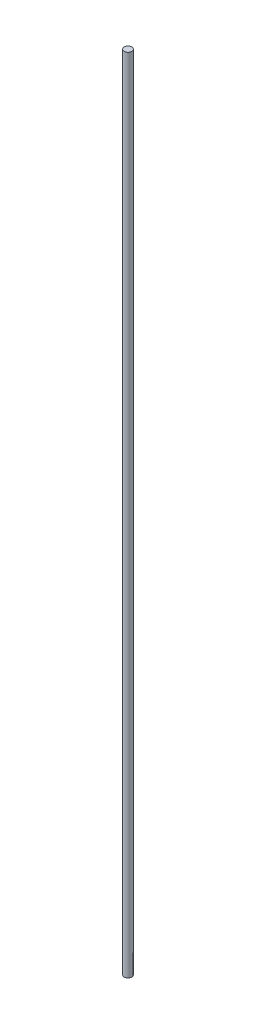
ISO-10303-21;
HEADER;
FILE_DESCRIPTION(('STEP AP214'),'2;1');
FILE_NAME('part.step','',(''),(''),'','','');
FILE_SCHEMA(('AUTOMOTIVE_DESIGN { 1 0 10303 214 1 1 1 1 }'));
ENDSEC;
DATA;
#1=APPLICATION_CONTEXT('core data for automotive mechanical design processes');
#2=APPLICATION_PROTOCOL_DEFINITION('international standard','automotive_design',2000,#1);
#3=PRODUCT_CONTEXT('',#1,'mechanical');
#4=PRODUCT('Part','Part','',(#3));
#5=PRODUCT_RELATED_PRODUCT_CATEGORY('part','',(#4));
#6=PRODUCT_DEFINITION_FORMATION('','',#4);
#7=PRODUCT_DEFINITION_CONTEXT('part definition',#1,'design');
#8=PRODUCT_DEFINITION('design','',#6,#7);
#9=PRODUCT_DEFINITION_SHAPE('','',#8);
#10=(LENGTH_UNIT() NAMED_UNIT(*) SI_UNIT(.MILLI.,.METRE.));
#11=(NAMED_UNIT(*) PLANE_ANGLE_UNIT() SI_UNIT($,.RADIAN.));
#12=(NAMED_UNIT(*) SI_UNIT($,.STERADIAN.) SOLID_ANGLE_UNIT());
#13=UNCERTAINTY_MEASURE_WITH_UNIT(LENGTH_MEASURE(1.E-05),#10,'distance_accuracy_value','');
#14=(GEOMETRIC_REPRESENTATION_CONTEXT(3) GLOBAL_UNCERTAINTY_ASSIGNED_CONTEXT((#13)) GLOBAL_UNIT_ASSIGNED_CONTEXT((#10,
#11,#12)) REPRESENTATION_CONTEXT('',''));
#15=CARTESIAN_POINT('',(0.,0.,0.));
#16=DIRECTION('',(0.,0.,1.));
#17=DIRECTION('',(1.,0.,0.));
#18=AXIS2_PLACEMENT_3D('',#15,#16,#17);
#19=CARTESIAN_POINT('',(0.,-330.2,0.));
#20=DIRECTION('',(0.,1.,0.));
#21=DIRECTION('',(0.,0.,1.));
#22=AXIS2_PLACEMENT_3D('',#19,#20,#21);
#23=CYLINDRICAL_SURFACE('',#22,3.175);
#24=CARTESIAN_POINT('',(0.,-330.2,0.));
#25=DIRECTION('',(0.,1.,0.));
#26=DIRECTION('',(0.,0.,1.));
#27=AXIS2_PLACEMENT_3D('',#24,#25,#26);
#28=CIRCLE('',#27,3.175);
#29=CARTESIAN_POINT('',(0.,-330.2,3.175));
#30=VERTEX_POINT('',#29);
#31=EDGE_CURVE('E10',#30,#30,#28,.T.);
#32=ORIENTED_EDGE('',*,*,#31,.T.);
#33=EDGE_LOOP('',(#32));
#34=FACE_BOUND('',#33,.T.);
#35=CARTESIAN_POINT('',(0.,330.2,0.));
#36=DIRECTION('',(0.,1.,0.));
#37=DIRECTION('',(0.,0.,1.));
#38=AXIS2_PLACEMENT_3D('',#35,#36,#37);
#39=CIRCLE('',#38,3.175);
#40=CARTESIAN_POINT('',(0.,330.2,3.175));
#41=VERTEX_POINT('',#40);
#42=EDGE_CURVE('E36',#41,#41,#39,.T.);
#43=ORIENTED_EDGE('',*,*,#42,.F.);
#44=EDGE_LOOP('',(#43));
#45=FACE_BOUND('',#44,.T.);
#46=ADVANCED_FACE('F30',(#34,#45),#23,.T.);
#47=CARTESIAN_POINT('',(0.,-330.2,0.));
#48=DIRECTION('',(0.,1.,0.));
#49=DIRECTION('',(0.,0.,1.));
#50=AXIS2_PLACEMENT_3D('',#47,#48,#49);
#51=PLANE('',#50);
#52=ORIENTED_EDGE('',*,*,#31,.F.);
#53=EDGE_LOOP('',(#52));
#54=FACE_BOUND('',#53,.T.);
#55=ADVANCED_FACE('F45',(#54),#51,.F.);
#56=CARTESIAN_POINT('',(0.,330.2,0.));
#57=DIRECTION('',(0.,1.,0.));
#58=DIRECTION('',(0.,0.,1.));
#59=AXIS2_PLACEMENT_3D('',#56,#57,#58);
#60=PLANE('',#59);
#61=ORIENTED_EDGE('',*,*,#42,.T.);
#62=EDGE_LOOP('',(#61));
#63=FACE_BOUND('',#62,.T.);
#64=ADVANCED_FACE('F42',(#63),#60,.T.);
#65=CLOSED_SHELL('',(#46,#55,#64));
#66=MANIFOLD_SOLID_BREP('B2',#65);
#67=ADVANCED_BREP_SHAPE_REPRESENTATION('',(#18,#66),#14);
#68=SHAPE_DEFINITION_REPRESENTATION(#9,#67);
ENDSEC;
END-ISO-10303-21;
